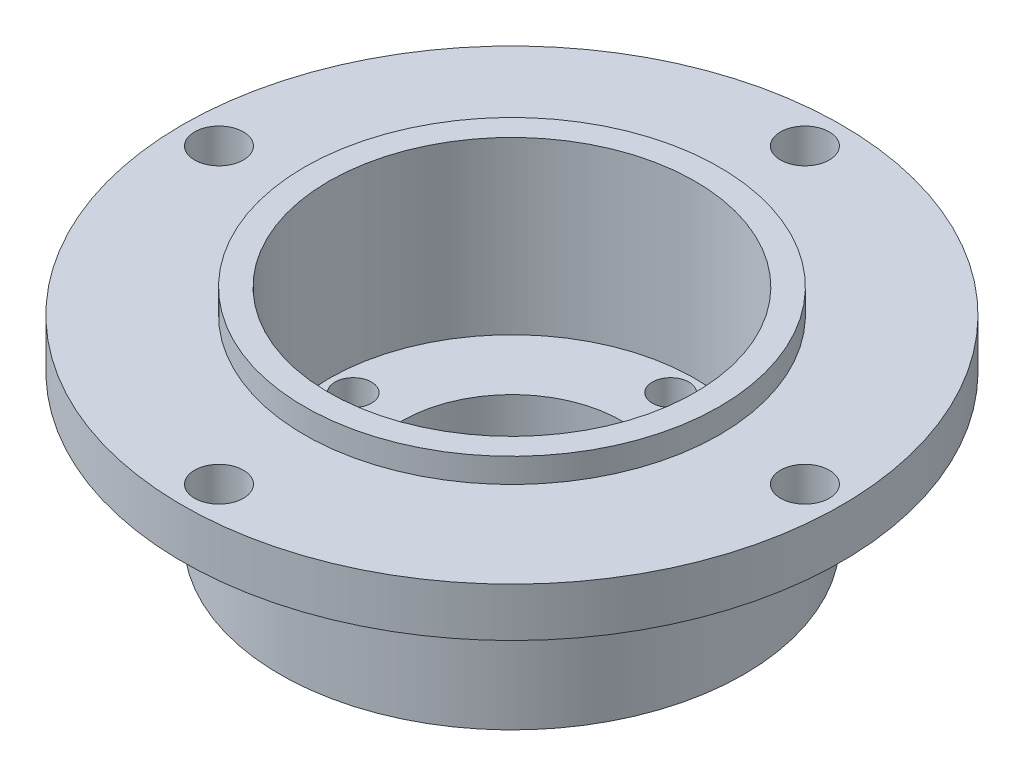
ISO-10303-21;
HEADER;
FILE_DESCRIPTION(('STEP AP214'),'2;1');
FILE_NAME('part.step','',(''),(''),'','','');
FILE_SCHEMA(('AUTOMOTIVE_DESIGN { 1 0 10303 214 1 1 1 1 }'));
ENDSEC;
DATA;
#1=APPLICATION_CONTEXT('core data for automotive mechanical design processes');
#2=APPLICATION_PROTOCOL_DEFINITION('international standard','automotive_design',2000,#1);
#3=PRODUCT_CONTEXT('',#1,'mechanical');
#4=PRODUCT('Part','Part','',(#3));
#5=PRODUCT_RELATED_PRODUCT_CATEGORY('part','',(#4));
#6=PRODUCT_DEFINITION_FORMATION('','',#4);
#7=PRODUCT_DEFINITION_CONTEXT('part definition',#1,'design');
#8=PRODUCT_DEFINITION('design','',#6,#7);
#9=PRODUCT_DEFINITION_SHAPE('','',#8);
#10=(LENGTH_UNIT() NAMED_UNIT(*) SI_UNIT(.MILLI.,.METRE.));
#11=(NAMED_UNIT(*) PLANE_ANGLE_UNIT() SI_UNIT($,.RADIAN.));
#12=(NAMED_UNIT(*) SI_UNIT($,.STERADIAN.) SOLID_ANGLE_UNIT());
#13=UNCERTAINTY_MEASURE_WITH_UNIT(LENGTH_MEASURE(1.E-05),#10,'distance_accuracy_value','');
#14=(GEOMETRIC_REPRESENTATION_CONTEXT(3) GLOBAL_UNCERTAINTY_ASSIGNED_CONTEXT((#13)) GLOBAL_UNIT_ASSIGNED_CONTEXT((#10,
#11,#12)) REPRESENTATION_CONTEXT('',''));
#15=CARTESIAN_POINT('',(0.,0.,0.));
#16=DIRECTION('',(0.,0.,1.));
#17=DIRECTION('',(1.,0.,0.));
#18=AXIS2_PLACEMENT_3D('',#15,#16,#17);
#19=CARTESIAN_POINT('',(15.,-20.,0.));
#20=DIRECTION('',(0.,-1.,0.));
#21=DIRECTION('',(1.,0.,0.));
#22=AXIS2_PLACEMENT_3D('',#19,#20,#21);
#23=PLANE('',#22);
#24=CARTESIAN_POINT('',(-12.9999999999998,-20.,-1.81557108488227E-13));
#25=DIRECTION('',(0.,-1.,0.));
#26=DIRECTION('',(1.,0.,0.));
#27=AXIS2_PLACEMENT_3D('',#24,#25,#26);
#28=CIRCLE('',#27,1.50000000000036);
#29=CARTESIAN_POINT('',(-11.4999999999995,-20.,-1.81557108488227E-13));
#30=VERTEX_POINT('',#29);
#31=EDGE_CURVE('E72',#30,#30,#28,.T.);
#32=ORIENTED_EDGE('',*,*,#31,.T.);
#33=EDGE_LOOP('',(#32));
#34=FACE_BOUND('',#33,.T.);
#35=CARTESIAN_POINT('',(3.68747592252531E-13,-20.,-13.));
#36=DIRECTION('',(0.,-1.,0.));
#37=DIRECTION('',(1.,0.,0.));
#38=AXIS2_PLACEMENT_3D('',#35,#36,#37);
#39=CIRCLE('',#38,1.50000000000044);
#40=CARTESIAN_POINT('',(1.50000000000081,-20.,-13.));
#41=VERTEX_POINT('',#40);
#42=EDGE_CURVE('E78',#41,#41,#39,.T.);
#43=ORIENTED_EDGE('',*,*,#42,.T.);
#44=EDGE_LOOP('',(#43));
#45=FACE_BOUND('',#44,.T.);
#46=CARTESIAN_POINT('',(13.,-20.,0.));
#47=DIRECTION('',(0.,-1.,0.));
#48=DIRECTION('',(1.,0.,0.));
#49=AXIS2_PLACEMENT_3D('',#46,#47,#48);
#50=CIRCLE('',#49,1.5);
#51=CARTESIAN_POINT('',(14.5,-20.,0.));
#52=VERTEX_POINT('',#51);
#53=EDGE_CURVE('E84',#52,#52,#50,.T.);
#54=ORIENTED_EDGE('',*,*,#53,.T.);
#55=EDGE_LOOP('',(#54));
#56=FACE_BOUND('',#55,.T.);
#57=CARTESIAN_POINT('',(0.,-20.,13.));
#58=DIRECTION('',(0.,-1.,0.));
#59=DIRECTION('',(1.,0.,0.));
#60=AXIS2_PLACEMENT_3D('',#57,#58,#59);
#61=CIRCLE('',#60,1.5);
#62=CARTESIAN_POINT('',(1.5,-20.,13.));
#63=VERTEX_POINT('',#62);
#64=EDGE_CURVE('E90',#63,#63,#61,.T.);
#65=ORIENTED_EDGE('',*,*,#64,.T.);
#66=EDGE_LOOP('',(#65));
#67=FACE_BOUND('',#66,.T.);
#68=CARTESIAN_POINT('',(0.,-20.,0.));
#69=DIRECTION('',(0.,1.,0.));
#70=DIRECTION('',(-1.,0.,0.));
#71=AXIS2_PLACEMENT_3D('',#68,#69,#70);
#72=CIRCLE('',#71,9.);
#73=CARTESIAN_POINT('',(-9.,-20.,0.));
#74=VERTEX_POINT('',#73);
#75=EDGE_CURVE('E10',#74,#74,#72,.T.);
#76=ORIENTED_EDGE('',*,*,#75,.F.);
#77=EDGE_LOOP('',(#76));
#78=FACE_BOUND('',#77,.T.);
#79=CARTESIAN_POINT('',(0.,-20.,0.));
#80=DIRECTION('',(0.,1.,0.));
#81=DIRECTION('',(-1.,0.,0.));
#82=AXIS2_PLACEMENT_3D('',#79,#80,#81);
#83=CIRCLE('',#82,15.);
#84=CARTESIAN_POINT('',(-15.,-20.,0.));
#85=VERTEX_POINT('',#84);
#86=EDGE_CURVE('E93',#85,#85,#83,.T.);
#87=ORIENTED_EDGE('',*,*,#86,.T.);
#88=EDGE_LOOP('',(#87));
#89=FACE_BOUND('',#88,.T.);
#90=ADVANCED_FACE('F29',(#34,#45,#56,#67,#78,#89),#23,.F.);
#91=CARTESIAN_POINT('',(0.,0.,0.));
#92=DIRECTION('',(0.,1.,0.));
#93=DIRECTION('',(-1.,0.,0.));
#94=AXIS2_PLACEMENT_3D('',#91,#92,#93);
#95=CYLINDRICAL_SURFACE('',#94,9.);
#96=CARTESIAN_POINT('',(0.,-24.,0.));
#97=DIRECTION('',(0.,1.,0.));
#98=DIRECTION('',(-1.,0.,0.));
#99=AXIS2_PLACEMENT_3D('',#96,#97,#98);
#100=CIRCLE('',#99,9.);
#101=CARTESIAN_POINT('',(-8.99999999999999,-24.,0.));
#102=VERTEX_POINT('',#101);
#103=EDGE_CURVE('E36',#102,#102,#100,.T.);
#104=ORIENTED_EDGE('',*,*,#103,.F.);
#105=EDGE_LOOP('',(#104));
#106=FACE_BOUND('',#105,.T.);
#107=ORIENTED_EDGE('',*,*,#75,.T.);
#108=EDGE_LOOP('',(#107));
#109=FACE_BOUND('',#108,.T.);
#110=ADVANCED_FACE('F121',(#106,#109),#95,.F.);
#111=CARTESIAN_POINT('',(9.,-24.,0.));
#112=DIRECTION('',(0.,1.,0.));
#113=DIRECTION('',(-1.,0.,0.));
#114=AXIS2_PLACEMENT_3D('',#111,#112,#113);
#115=PLANE('',#114);
#116=CARTESIAN_POINT('',(-12.9999999999998,-24.,-1.81557108488227E-13));
#117=DIRECTION('',(0.,-1.,0.));
#118=DIRECTION('',(1.,0.,0.));
#119=AXIS2_PLACEMENT_3D('',#116,#117,#118);
#120=CIRCLE('',#119,1.50000000000036);
#121=CARTESIAN_POINT('',(-11.4999999999995,-24.,-1.81557108488227E-13));
#122=VERTEX_POINT('',#121);
#123=EDGE_CURVE('E48',#122,#122,#120,.T.);
#124=ORIENTED_EDGE('',*,*,#123,.F.);
#125=EDGE_LOOP('',(#124));
#126=FACE_BOUND('',#125,.T.);
#127=CARTESIAN_POINT('',(3.6923745097219E-13,-24.,-13.));
#128=DIRECTION('',(0.,-1.,0.));
#129=DIRECTION('',(1.,0.,0.));
#130=AXIS2_PLACEMENT_3D('',#127,#128,#129);
#131=CIRCLE('',#130,1.50000000000044);
#132=CARTESIAN_POINT('',(1.50000000000081,-24.,-13.));
#133=VERTEX_POINT('',#132);
#134=EDGE_CURVE('E75',#133,#133,#131,.T.);
#135=ORIENTED_EDGE('',*,*,#134,.F.);
#136=EDGE_LOOP('',(#135));
#137=FACE_BOUND('',#136,.T.);
#138=CARTESIAN_POINT('',(13.,-24.,0.));
#139=DIRECTION('',(0.,-1.,0.));
#140=DIRECTION('',(1.,0.,0.));
#141=AXIS2_PLACEMENT_3D('',#138,#139,#140);
#142=CIRCLE('',#141,1.5);
#143=CARTESIAN_POINT('',(14.5,-24.,0.));
#144=VERTEX_POINT('',#143);
#145=EDGE_CURVE('E81',#144,#144,#142,.T.);
#146=ORIENTED_EDGE('',*,*,#145,.F.);
#147=EDGE_LOOP('',(#146));
#148=FACE_BOUND('',#147,.T.);
#149=CARTESIAN_POINT('',(0.,-24.,13.));
#150=DIRECTION('',(0.,-1.,0.));
#151=DIRECTION('',(1.,0.,0.));
#152=AXIS2_PLACEMENT_3D('',#149,#150,#151);
#153=CIRCLE('',#152,1.5);
#154=CARTESIAN_POINT('',(1.5,-24.,13.));
#155=VERTEX_POINT('',#154);
#156=EDGE_CURVE('E87',#155,#155,#153,.T.);
#157=ORIENTED_EDGE('',*,*,#156,.F.);
#158=EDGE_LOOP('',(#157));
#159=FACE_BOUND('',#158,.T.);
#160=CARTESIAN_POINT('',(0.,-24.,0.));
#161=DIRECTION('',(0.,1.,0.));
#162=DIRECTION('',(-1.,0.,0.));
#163=AXIS2_PLACEMENT_3D('',#160,#161,#162);
#164=CIRCLE('',#163,19.);
#165=CARTESIAN_POINT('',(-19.,-24.,0.));
#166=VERTEX_POINT('',#165);
#167=EDGE_CURVE('E41',#166,#166,#164,.T.);
#168=ORIENTED_EDGE('',*,*,#167,.F.);
#169=EDGE_LOOP('',(#168));
#170=FACE_BOUND('',#169,.T.);
#171=ORIENTED_EDGE('',*,*,#103,.T.);
#172=EDGE_LOOP('',(#171));
#173=FACE_BOUND('',#172,.T.);
#174=ADVANCED_FACE('F118',(#126,#137,#148,#159,#170,#173),#115,.F.);
#175=CARTESIAN_POINT('',(0.,0.,0.));
#176=DIRECTION('',(0.,1.,0.));
#177=DIRECTION('',(-1.,0.,0.));
#178=AXIS2_PLACEMENT_3D('',#175,#176,#177);
#179=CYLINDRICAL_SURFACE('',#178,19.);
#180=CARTESIAN_POINT('',(0.,-12.,0.));
#181=DIRECTION('',(0.,1.,0.));
#182=DIRECTION('',(-1.,0.,0.));
#183=AXIS2_PLACEMENT_3D('',#180,#181,#182);
#184=CIRCLE('',#183,19.);
#185=CARTESIAN_POINT('',(-19.,-12.,0.));
#186=VERTEX_POINT('',#185);
#187=EDGE_CURVE('E111',#186,#186,#184,.T.);
#188=ORIENTED_EDGE('',*,*,#187,.F.);
#189=EDGE_LOOP('',(#188));
#190=FACE_BOUND('',#189,.T.);
#191=ORIENTED_EDGE('',*,*,#167,.T.);
#192=EDGE_LOOP('',(#191));
#193=FACE_BOUND('',#192,.T.);
#194=ADVANCED_FACE('F116',(#190,#193),#179,.T.);
#195=CARTESIAN_POINT('',(19.,-12.,0.));
#196=DIRECTION('',(0.,1.,0.));
#197=DIRECTION('',(-1.,0.,0.));
#198=AXIS2_PLACEMENT_3D('',#195,#196,#197);
#199=PLANE('',#198);
#200=CARTESIAN_POINT('',(-23.9999999999997,-12.,-3.35182354132111E-13));
#201=DIRECTION('',(0.,-1.,0.));
#202=DIRECTION('',(1.,0.,0.));
#203=AXIS2_PLACEMENT_3D('',#200,#201,#202);
#204=CIRCLE('',#203,2.00000000000066);
#205=CARTESIAN_POINT('',(-21.999999999999,-12.,-3.35182354132111E-13));
#206=VERTEX_POINT('',#205);
#207=EDGE_CURVE('E65',#206,#206,#204,.T.);
#208=ORIENTED_EDGE('',*,*,#207,.F.);
#209=EDGE_LOOP('',(#208));
#210=FACE_BOUND('',#209,.T.);
#211=CARTESIAN_POINT('',(6.77712589059106E-13,-12.,-24.));
#212=DIRECTION('',(0.,-1.,0.));
#213=DIRECTION('',(1.,0.,0.));
#214=AXIS2_PLACEMENT_3D('',#211,#212,#213);
#215=CIRCLE('',#214,2.00000000000081);
#216=CARTESIAN_POINT('',(2.00000000000149,-12.,-24.));
#217=VERTEX_POINT('',#216);
#218=EDGE_CURVE('E55',#217,#217,#215,.T.);
#219=ORIENTED_EDGE('',*,*,#218,.F.);
#220=EDGE_LOOP('',(#219));
#221=FACE_BOUND('',#220,.T.);
#222=CARTESIAN_POINT('',(24.,-12.,0.));
#223=DIRECTION('',(0.,-1.,0.));
#224=DIRECTION('',(1.,0.,0.));
#225=AXIS2_PLACEMENT_3D('',#222,#223,#224);
#226=CIRCLE('',#225,2.);
#227=CARTESIAN_POINT('',(26.,-12.,0.));
#228=VERTEX_POINT('',#227);
#229=EDGE_CURVE('E52',#228,#228,#226,.T.);
#230=ORIENTED_EDGE('',*,*,#229,.F.);
#231=EDGE_LOOP('',(#230));
#232=FACE_BOUND('',#231,.T.);
#233=CARTESIAN_POINT('',(0.,-12.,24.));
#234=DIRECTION('',(0.,-1.,0.));
#235=DIRECTION('',(1.,0.,0.));
#236=AXIS2_PLACEMENT_3D('',#233,#234,#235);
#237=CIRCLE('',#236,2.);
#238=CARTESIAN_POINT('',(2.,-12.,24.));
#239=VERTEX_POINT('',#238);
#240=EDGE_CURVE('E49',#239,#239,#237,.T.);
#241=ORIENTED_EDGE('',*,*,#240,.F.);
#242=EDGE_LOOP('',(#241));
#243=FACE_BOUND('',#242,.T.);
#244=CARTESIAN_POINT('',(0.,-12.,0.));
#245=DIRECTION('',(0.,1.,0.));
#246=DIRECTION('',(-1.,0.,0.));
#247=AXIS2_PLACEMENT_3D('',#244,#245,#246);
#248=CIRCLE('',#247,27.);
#249=CARTESIAN_POINT('',(-27.,-12.,0.));
#250=VERTEX_POINT('',#249);
#251=EDGE_CURVE('E108',#250,#250,#248,.T.);
#252=ORIENTED_EDGE('',*,*,#251,.F.);
#253=EDGE_LOOP('',(#252));
#254=FACE_BOUND('',#253,.T.);
#255=ORIENTED_EDGE('',*,*,#187,.T.);
#256=EDGE_LOOP('',(#255));
#257=FACE_BOUND('',#256,.T.);
#258=ADVANCED_FACE('F134',(#210,#221,#232,#243,#254,#257),#199,.F.);
#259=CARTESIAN_POINT('',(0.,0.,0.));
#260=DIRECTION('',(0.,1.,0.));
#261=DIRECTION('',(-1.,0.,0.));
#262=AXIS2_PLACEMENT_3D('',#259,#260,#261);
#263=CYLINDRICAL_SURFACE('',#262,27.);
#264=CARTESIAN_POINT('',(0.,-8.,0.));
#265=DIRECTION('',(0.,1.,0.));
#266=DIRECTION('',(-1.,0.,0.));
#267=AXIS2_PLACEMENT_3D('',#264,#265,#266);
#268=CIRCLE('',#267,27.);
#269=CARTESIAN_POINT('',(-27.,-8.00000000000001,0.));
#270=VERTEX_POINT('',#269);
#271=EDGE_CURVE('E105',#270,#270,#268,.T.);
#272=ORIENTED_EDGE('',*,*,#271,.F.);
#273=EDGE_LOOP('',(#272));
#274=FACE_BOUND('',#273,.T.);
#275=ORIENTED_EDGE('',*,*,#251,.T.);
#276=EDGE_LOOP('',(#275));
#277=FACE_BOUND('',#276,.T.);
#278=ADVANCED_FACE('F138',(#274,#277),#263,.T.);
#279=CARTESIAN_POINT('',(27.,-8.,0.));
#280=DIRECTION('',(0.,-1.,0.));
#281=DIRECTION('',(1.,0.,0.));
#282=AXIS2_PLACEMENT_3D('',#279,#280,#281);
#283=PLANE('',#282);
#284=CARTESIAN_POINT('',(-23.9999999999997,-8.00000000000001,-3.35182354132111E-13));
#285=DIRECTION('',(0.,-1.,0.));
#286=DIRECTION('',(1.,0.,0.));
#287=AXIS2_PLACEMENT_3D('',#284,#285,#286);
#288=CIRCLE('',#287,2.00000000000066);
#289=CARTESIAN_POINT('',(-21.999999999999,-8.00000000000001,-3.35182354132111E-13));
#290=VERTEX_POINT('',#289);
#291=EDGE_CURVE('E32',#290,#290,#288,.T.);
#292=ORIENTED_EDGE('',*,*,#291,.T.);
#293=EDGE_LOOP('',(#292));
#294=FACE_BOUND('',#293,.T.);
#295=CARTESIAN_POINT('',(6.77222730339447E-13,-8.,-24.));
#296=DIRECTION('',(0.,-1.,0.));
#297=DIRECTION('',(1.,0.,0.));
#298=AXIS2_PLACEMENT_3D('',#295,#296,#297);
#299=CIRCLE('',#298,2.00000000000081);
#300=CARTESIAN_POINT('',(2.00000000000149,-8.,-24.));
#301=VERTEX_POINT('',#300);
#302=EDGE_CURVE('E53',#301,#301,#299,.T.);
#303=ORIENTED_EDGE('',*,*,#302,.T.);
#304=EDGE_LOOP('',(#303));
#305=FACE_BOUND('',#304,.T.);
#306=CARTESIAN_POINT('',(24.,-8.,0.));
#307=DIRECTION('',(0.,-1.,0.));
#308=DIRECTION('',(1.,0.,0.));
#309=AXIS2_PLACEMENT_3D('',#306,#307,#308);
#310=CIRCLE('',#309,2.);
#311=CARTESIAN_POINT('',(26.,-8.,0.));
#312=VERTEX_POINT('',#311);
#313=EDGE_CURVE('E50',#312,#312,#310,.T.);
#314=ORIENTED_EDGE('',*,*,#313,.T.);
#315=EDGE_LOOP('',(#314));
#316=FACE_BOUND('',#315,.T.);
#317=CARTESIAN_POINT('',(0.,-8.,24.));
#318=DIRECTION('',(0.,-1.,0.));
#319=DIRECTION('',(1.,0.,0.));
#320=AXIS2_PLACEMENT_3D('',#317,#318,#319);
#321=CIRCLE('',#320,2.);
#322=CARTESIAN_POINT('',(2.,-8.,24.));
#323=VERTEX_POINT('',#322);
#324=EDGE_CURVE('E45',#323,#323,#321,.T.);
#325=ORIENTED_EDGE('',*,*,#324,.T.);
#326=EDGE_LOOP('',(#325));
#327=FACE_BOUND('',#326,.T.);
#328=CARTESIAN_POINT('',(0.,-8.,0.));
#329=DIRECTION('',(0.,1.,0.));
#330=DIRECTION('',(-1.,0.,0.));
#331=AXIS2_PLACEMENT_3D('',#328,#329,#330);
#332=CIRCLE('',#331,17.);
#333=CARTESIAN_POINT('',(-17.,-8.,0.));
#334=VERTEX_POINT('',#333);
#335=EDGE_CURVE('E102',#334,#334,#332,.T.);
#336=ORIENTED_EDGE('',*,*,#335,.F.);
#337=EDGE_LOOP('',(#336));
#338=FACE_BOUND('',#337,.T.);
#339=ORIENTED_EDGE('',*,*,#271,.T.);
#340=EDGE_LOOP('',(#339));
#341=FACE_BOUND('',#340,.T.);
#342=ADVANCED_FACE('F142',(#294,#305,#316,#327,#338,#341),#283,.F.);
#343=CARTESIAN_POINT('',(0.,0.,0.));
#344=DIRECTION('',(0.,1.,0.));
#345=DIRECTION('',(-1.,0.,0.));
#346=AXIS2_PLACEMENT_3D('',#343,#344,#345);
#347=CYLINDRICAL_SURFACE('',#346,17.);
#348=CARTESIAN_POINT('',(0.,-6.,0.));
#349=DIRECTION('',(0.,1.,0.));
#350=DIRECTION('',(-1.,0.,0.));
#351=AXIS2_PLACEMENT_3D('',#348,#349,#350);
#352=CIRCLE('',#351,17.);
#353=CARTESIAN_POINT('',(-17.,-6.,0.));
#354=VERTEX_POINT('',#353);
#355=EDGE_CURVE('E99',#354,#354,#352,.T.);
#356=ORIENTED_EDGE('',*,*,#355,.F.);
#357=EDGE_LOOP('',(#356));
#358=FACE_BOUND('',#357,.T.);
#359=ORIENTED_EDGE('',*,*,#335,.T.);
#360=EDGE_LOOP('',(#359));
#361=FACE_BOUND('',#360,.T.);
#362=ADVANCED_FACE('F146',(#358,#361),#347,.T.);
#363=CARTESIAN_POINT('',(17.,-6.,0.));
#364=DIRECTION('',(0.,-1.,0.));
#365=DIRECTION('',(1.,0.,0.));
#366=AXIS2_PLACEMENT_3D('',#363,#364,#365);
#367=PLANE('',#366);
#368=CARTESIAN_POINT('',(0.,-6.,0.));
#369=DIRECTION('',(0.,1.,0.));
#370=DIRECTION('',(-1.,0.,0.));
#371=AXIS2_PLACEMENT_3D('',#368,#369,#370);
#372=CIRCLE('',#371,15.);
#373=CARTESIAN_POINT('',(-15.,-6.,0.));
#374=VERTEX_POINT('',#373);
#375=EDGE_CURVE('E96',#374,#374,#372,.T.);
#376=ORIENTED_EDGE('',*,*,#375,.F.);
#377=EDGE_LOOP('',(#376));
#378=FACE_BOUND('',#377,.T.);
#379=ORIENTED_EDGE('',*,*,#355,.T.);
#380=EDGE_LOOP('',(#379));
#381=FACE_BOUND('',#380,.T.);
#382=ADVANCED_FACE('F150',(#378,#381),#367,.F.);
#383=CARTESIAN_POINT('',(0.,0.,0.));
#384=DIRECTION('',(0.,1.,0.));
#385=DIRECTION('',(-1.,0.,0.));
#386=AXIS2_PLACEMENT_3D('',#383,#384,#385);
#387=CYLINDRICAL_SURFACE('',#386,15.);
#388=ORIENTED_EDGE('',*,*,#86,.F.);
#389=EDGE_LOOP('',(#388));
#390=FACE_BOUND('',#389,.T.);
#391=ORIENTED_EDGE('',*,*,#375,.T.);
#392=EDGE_LOOP('',(#391));
#393=FACE_BOUND('',#392,.T.);
#394=ADVANCED_FACE('F154',(#390,#393),#387,.F.);
#395=CARTESIAN_POINT('',(0.,-5.99999999999999,13.));
#396=DIRECTION('',(0.,-1.,0.));
#397=DIRECTION('',(1.,0.,0.));
#398=AXIS2_PLACEMENT_3D('',#395,#396,#397);
#399=CYLINDRICAL_SURFACE('',#398,1.5);
#400=ORIENTED_EDGE('',*,*,#156,.T.);
#401=EDGE_LOOP('',(#400));
#402=FACE_BOUND('',#401,.T.);
#403=ORIENTED_EDGE('',*,*,#64,.F.);
#404=EDGE_LOOP('',(#403));
#405=FACE_BOUND('',#404,.T.);
#406=ADVANCED_FACE('F158',(#402,#405),#399,.F.);
#407=CARTESIAN_POINT('',(13.,-5.99999999999999,0.));
#408=DIRECTION('',(0.,-1.,0.));
#409=DIRECTION('',(1.,0.,0.));
#410=AXIS2_PLACEMENT_3D('',#407,#408,#409);
#411=CYLINDRICAL_SURFACE('',#410,1.5);
#412=ORIENTED_EDGE('',*,*,#145,.T.);
#413=EDGE_LOOP('',(#412));
#414=FACE_BOUND('',#413,.T.);
#415=ORIENTED_EDGE('',*,*,#53,.F.);
#416=EDGE_LOOP('',(#415));
#417=FACE_BOUND('',#416,.T.);
#418=ADVANCED_FACE('F162',(#414,#417),#411,.F.);
#419=CARTESIAN_POINT('',(3.67033086733725E-13,-5.99999999999999,-13.));
#420=DIRECTION('',(0.,-1.,0.));
#421=DIRECTION('',(1.,0.,0.));
#422=AXIS2_PLACEMENT_3D('',#419,#420,#421);
#423=CYLINDRICAL_SURFACE('',#422,1.50000000000044);
#424=ORIENTED_EDGE('',*,*,#134,.T.);
#425=EDGE_LOOP('',(#424));
#426=FACE_BOUND('',#425,.T.);
#427=ORIENTED_EDGE('',*,*,#42,.F.);
#428=EDGE_LOOP('',(#427));
#429=FACE_BOUND('',#428,.T.);
#430=ADVANCED_FACE('F166',(#426,#429),#423,.F.);
#431=CARTESIAN_POINT('',(-12.9999999999998,-5.99999999999999,-1.81557108488227E-13));
#432=DIRECTION('',(0.,-1.,0.));
#433=DIRECTION('',(1.,0.,0.));
#434=AXIS2_PLACEMENT_3D('',#431,#432,#433);
#435=CYLINDRICAL_SURFACE('',#434,1.50000000000036);
#436=ORIENTED_EDGE('',*,*,#123,.T.);
#437=EDGE_LOOP('',(#436));
#438=FACE_BOUND('',#437,.T.);
#439=ORIENTED_EDGE('',*,*,#31,.F.);
#440=EDGE_LOOP('',(#439));
#441=FACE_BOUND('',#440,.T.);
#442=ADVANCED_FACE('F170',(#438,#441),#435,.F.);
#443=CARTESIAN_POINT('',(0.,-5.99999999999999,24.));
#444=DIRECTION('',(0.,-1.,0.));
#445=DIRECTION('',(1.,0.,0.));
#446=AXIS2_PLACEMENT_3D('',#443,#444,#445);
#447=CYLINDRICAL_SURFACE('',#446,2.);
#448=ORIENTED_EDGE('',*,*,#240,.T.);
#449=EDGE_LOOP('',(#448));
#450=FACE_BOUND('',#449,.T.);
#451=ORIENTED_EDGE('',*,*,#324,.F.);
#452=EDGE_LOOP('',(#451));
#453=FACE_BOUND('',#452,.T.);
#454=ADVANCED_FACE('F174',(#450,#453),#447,.F.);
#455=CARTESIAN_POINT('',(24.,-5.99999999999999,0.));
#456=DIRECTION('',(0.,-1.,0.));
#457=DIRECTION('',(1.,0.,0.));
#458=AXIS2_PLACEMENT_3D('',#455,#456,#457);
#459=CYLINDRICAL_SURFACE('',#458,2.);
#460=ORIENTED_EDGE('',*,*,#229,.T.);
#461=EDGE_LOOP('',(#460));
#462=FACE_BOUND('',#461,.T.);
#463=ORIENTED_EDGE('',*,*,#313,.F.);
#464=EDGE_LOOP('',(#463));
#465=FACE_BOUND('',#464,.T.);
#466=ADVANCED_FACE('F178',(#462,#465),#459,.F.);
#467=CARTESIAN_POINT('',(6.76977800979617E-13,-5.99999999999999,-24.));
#468=DIRECTION('',(0.,-1.,0.));
#469=DIRECTION('',(1.,0.,0.));
#470=AXIS2_PLACEMENT_3D('',#467,#468,#469);
#471=CYLINDRICAL_SURFACE('',#470,2.00000000000081);
#472=ORIENTED_EDGE('',*,*,#218,.T.);
#473=EDGE_LOOP('',(#472));
#474=FACE_BOUND('',#473,.T.);
#475=ORIENTED_EDGE('',*,*,#302,.F.);
#476=EDGE_LOOP('',(#475));
#477=FACE_BOUND('',#476,.T.);
#478=ADVANCED_FACE('F182',(#474,#477),#471,.F.);
#479=CARTESIAN_POINT('',(-23.9999999999997,-6.,-3.35182354132111E-13));
#480=DIRECTION('',(0.,-1.,0.));
#481=DIRECTION('',(1.,0.,0.));
#482=AXIS2_PLACEMENT_3D('',#479,#480,#481);
#483=CYLINDRICAL_SURFACE('',#482,2.00000000000066);
#484=ORIENTED_EDGE('',*,*,#207,.T.);
#485=EDGE_LOOP('',(#484));
#486=FACE_BOUND('',#485,.T.);
#487=ORIENTED_EDGE('',*,*,#291,.F.);
#488=EDGE_LOOP('',(#487));
#489=FACE_BOUND('',#488,.T.);
#490=ADVANCED_FACE('F186',(#486,#489),#483,.F.);
#491=CLOSED_SHELL('',(#90,#110,#174,#194,#258,#278,#342,#362,#382,#394,#406,#418,#430,#442,#454,
#466,#478,#490));
#492=MANIFOLD_SOLID_BREP('B2',#491);
#493=ADVANCED_BREP_SHAPE_REPRESENTATION('',(#18,#492),#14);
#494=SHAPE_DEFINITION_REPRESENTATION(#9,#493);
ENDSEC;
END-ISO-10303-21;
